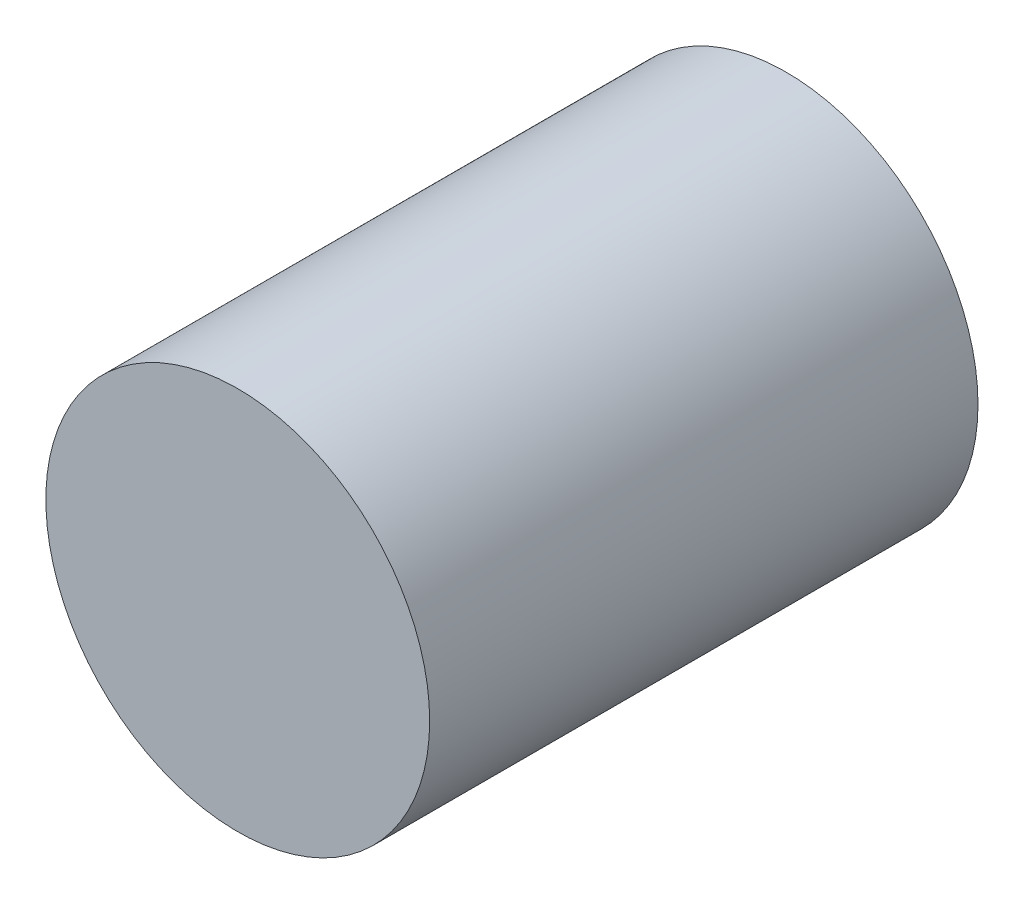
ISO-10303-21;
HEADER;
FILE_DESCRIPTION(('STEP AP214'),'2;1');
FILE_NAME('part.step','',(''),(''),'','','');
FILE_SCHEMA(('AUTOMOTIVE_DESIGN { 1 0 10303 214 1 1 1 1 }'));
ENDSEC;
DATA;
#1=APPLICATION_CONTEXT('core data for automotive mechanical design processes');
#2=APPLICATION_PROTOCOL_DEFINITION('international standard','automotive_design',2000,#1);
#3=PRODUCT_CONTEXT('',#1,'mechanical');
#4=PRODUCT('Part','Part','',(#3));
#5=PRODUCT_RELATED_PRODUCT_CATEGORY('part','',(#4));
#6=PRODUCT_DEFINITION_FORMATION('','',#4);
#7=PRODUCT_DEFINITION_CONTEXT('part definition',#1,'design');
#8=PRODUCT_DEFINITION('design','',#6,#7);
#9=PRODUCT_DEFINITION_SHAPE('','',#8);
#10=(LENGTH_UNIT() NAMED_UNIT(*) SI_UNIT(.MILLI.,.METRE.));
#11=(NAMED_UNIT(*) PLANE_ANGLE_UNIT() SI_UNIT($,.RADIAN.));
#12=(NAMED_UNIT(*) SI_UNIT($,.STERADIAN.) SOLID_ANGLE_UNIT());
#13=UNCERTAINTY_MEASURE_WITH_UNIT(LENGTH_MEASURE(1.E-05),#10,'distance_accuracy_value','');
#14=(GEOMETRIC_REPRESENTATION_CONTEXT(3) GLOBAL_UNCERTAINTY_ASSIGNED_CONTEXT((#13)) GLOBAL_UNIT_ASSIGNED_CONTEXT((#10,
#11,#12)) REPRESENTATION_CONTEXT('',''));
#15=CARTESIAN_POINT('',(0.,0.,0.));
#16=DIRECTION('',(0.,0.,1.));
#17=DIRECTION('',(1.,0.,0.));
#18=AXIS2_PLACEMENT_3D('',#15,#16,#17);
#19=CARTESIAN_POINT('',(0.,0.,400.));
#20=DIRECTION('',(0.,0.,-1.));
#21=DIRECTION('',(-1.,0.,0.));
#22=AXIS2_PLACEMENT_3D('',#19,#20,#21);
#23=CYLINDRICAL_SURFACE('',#22,140.);
#24=CARTESIAN_POINT('',(0.,0.,400.));
#25=DIRECTION('',(0.,0.,1.));
#26=DIRECTION('',(1.,0.,0.));
#27=AXIS2_PLACEMENT_3D('',#24,#25,#26);
#28=CIRCLE('',#27,140.);
#29=CARTESIAN_POINT('',(140.,0.,400.));
#30=VERTEX_POINT('',#29);
#31=EDGE_CURVE('E10',#30,#30,#28,.T.);
#32=ORIENTED_EDGE('',*,*,#31,.F.);
#33=EDGE_LOOP('',(#32));
#34=FACE_BOUND('',#33,.T.);
#35=CARTESIAN_POINT('',(0.,0.,0.));
#36=DIRECTION('',(0.,0.,1.));
#37=DIRECTION('',(1.,0.,0.));
#38=AXIS2_PLACEMENT_3D('',#35,#36,#37);
#39=CIRCLE('',#38,140.);
#40=CARTESIAN_POINT('',(140.,0.,0.));
#41=VERTEX_POINT('',#40);
#42=EDGE_CURVE('E36',#41,#41,#39,.T.);
#43=ORIENTED_EDGE('',*,*,#42,.T.);
#44=EDGE_LOOP('',(#43));
#45=FACE_BOUND('',#44,.T.);
#46=ADVANCED_FACE('F33',(#34,#45),#23,.T.);
#47=CARTESIAN_POINT('',(0.,0.,400.));
#48=DIRECTION('',(0.,0.,1.));
#49=DIRECTION('',(1.,0.,0.));
#50=AXIS2_PLACEMENT_3D('',#47,#48,#49);
#51=PLANE('',#50);
#52=ORIENTED_EDGE('',*,*,#31,.T.);
#53=EDGE_LOOP('',(#52));
#54=FACE_BOUND('',#53,.T.);
#55=ADVANCED_FACE('F48',(#54),#51,.T.);
#56=CARTESIAN_POINT('',(0.,0.,0.));
#57=DIRECTION('',(0.,0.,1.));
#58=DIRECTION('',(1.,0.,0.));
#59=AXIS2_PLACEMENT_3D('',#56,#57,#58);
#60=PLANE('',#59);
#61=ORIENTED_EDGE('',*,*,#42,.F.);
#62=EDGE_LOOP('',(#61));
#63=FACE_BOUND('',#62,.T.);
#64=ADVANCED_FACE('F46',(#63),#60,.F.);
#65=CLOSED_SHELL('',(#46,#55,#64));
#66=MANIFOLD_SOLID_BREP('B2',#65);
#67=ADVANCED_BREP_SHAPE_REPRESENTATION('',(#18,#66),#14);
#68=SHAPE_DEFINITION_REPRESENTATION(#9,#67);
ENDSEC;
END-ISO-10303-21;
